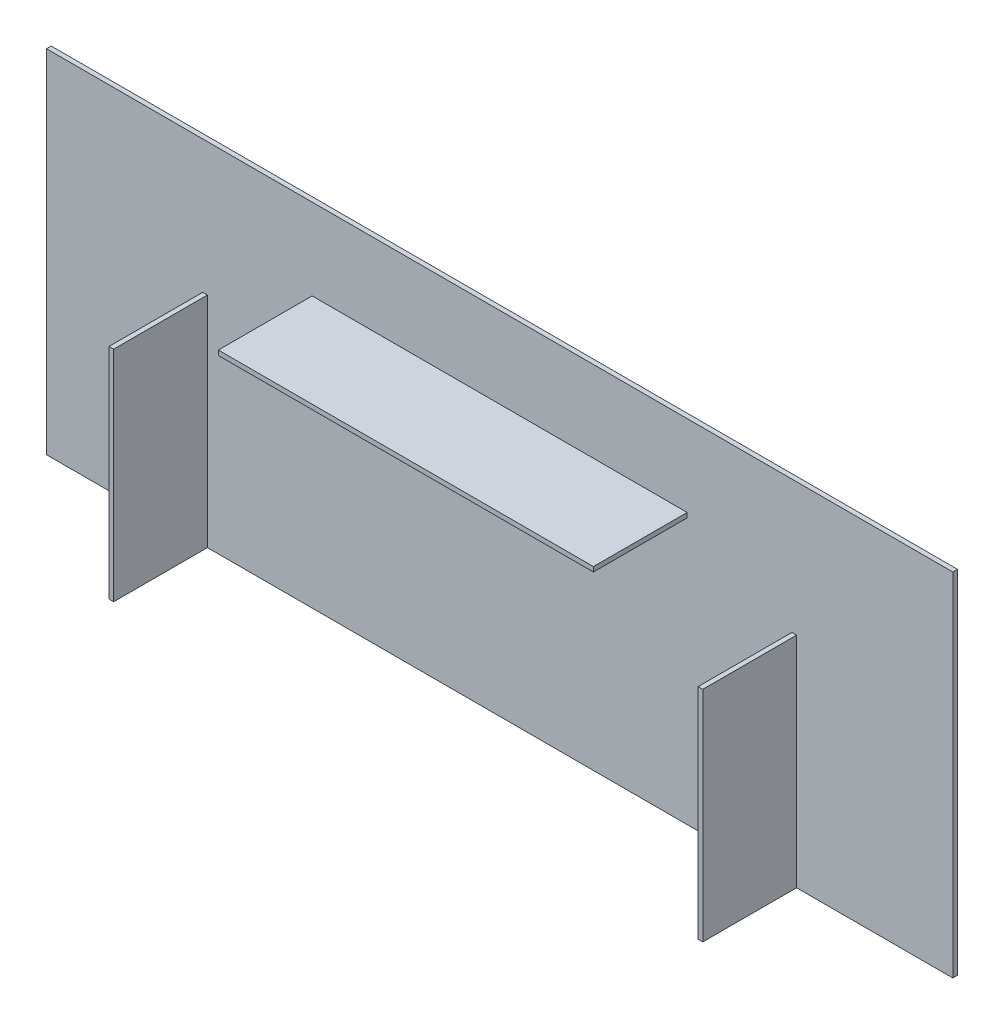
ISO-10303-21;
HEADER;
FILE_DESCRIPTION(('STEP AP214'),'2;1');
FILE_NAME('part.step','',(''),(''),'','','');
FILE_SCHEMA(('AUTOMOTIVE_DESIGN { 1 0 10303 214 1 1 1 1 }'));
ENDSEC;
DATA;
#1=APPLICATION_CONTEXT('core data for automotive mechanical design processes');
#2=APPLICATION_PROTOCOL_DEFINITION('international standard','automotive_design',2000,#1);
#3=PRODUCT_CONTEXT('',#1,'mechanical');
#4=PRODUCT('Part','Part','',(#3));
#5=PRODUCT_RELATED_PRODUCT_CATEGORY('part','',(#4));
#6=PRODUCT_DEFINITION_FORMATION('','',#4);
#7=PRODUCT_DEFINITION_CONTEXT('part definition',#1,'design');
#8=PRODUCT_DEFINITION('design','',#6,#7);
#9=PRODUCT_DEFINITION_SHAPE('','',#8);
#10=(LENGTH_UNIT() NAMED_UNIT(*) SI_UNIT(.MILLI.,.METRE.));
#11=(NAMED_UNIT(*) PLANE_ANGLE_UNIT() SI_UNIT($,.RADIAN.));
#12=(NAMED_UNIT(*) SI_UNIT($,.STERADIAN.) SOLID_ANGLE_UNIT());
#13=UNCERTAINTY_MEASURE_WITH_UNIT(LENGTH_MEASURE(1.E-05),#10,'distance_accuracy_value','');
#14=(GEOMETRIC_REPRESENTATION_CONTEXT(3) GLOBAL_UNCERTAINTY_ASSIGNED_CONTEXT((#13)) GLOBAL_UNIT_ASSIGNED_CONTEXT((#10,
#11,#12)) REPRESENTATION_CONTEXT('',''));
#15=CARTESIAN_POINT('',(0.,0.,0.));
#16=DIRECTION('',(0.,0.,1.));
#17=DIRECTION('',(1.,0.,0.));
#18=AXIS2_PLACEMENT_3D('',#15,#16,#17);
#19=CARTESIAN_POINT('',(0.,0.,1.5));
#20=DIRECTION('',(0.,0.,-1.));
#21=DIRECTION('',(-1.,0.,0.));
#22=AXIS2_PLACEMENT_3D('',#19,#20,#21);
#23=PLANE('',#22);
#24=DIRECTION('',(0.,-1.,0.));
#25=VECTOR('',#24,1.);
#26=CARTESIAN_POINT('',(-92.068661971831,56.7904929577465,1.5));
#27=LINE('',#26,#25);
#28=CARTESIAN_POINT('',(-92.068661971831,56.7904929577465,1.5));
#29=VERTEX_POINT('',#28);
#30=CARTESIAN_POINT('',(-92.068661971831,55.2904929577465,1.5));
#31=VERTEX_POINT('',#30);
#32=EDGE_CURVE('E229',#29,#31,#27,.T.);
#33=ORIENTED_EDGE('',*,*,#32,.F.);
#34=DIRECTION('',(1.,0.,0.));
#35=VECTOR('',#34,1.);
#36=CARTESIAN_POINT('',(-92.068661971831,56.7904929577465,1.5));
#37=LINE('',#36,#35);
#38=CARTESIAN_POINT('',(27.931338028169,56.7904929577465,1.5));
#39=VERTEX_POINT('',#38);
#40=EDGE_CURVE('E216',#29,#39,#37,.T.);
#41=ORIENTED_EDGE('',*,*,#40,.T.);
#42=DIRECTION('',(0.,-1.,0.));
#43=VECTOR('',#42,1.);
#44=CARTESIAN_POINT('',(27.931338028169,56.7904929577465,1.5));
#45=LINE('',#44,#43);
#46=CARTESIAN_POINT('',(27.931338028169,55.2904929577465,1.5));
#47=VERTEX_POINT('',#46);
#48=EDGE_CURVE('E220',#39,#47,#45,.T.);
#49=ORIENTED_EDGE('',*,*,#48,.T.);
#50=DIRECTION('',(1.,0.,0.));
#51=VECTOR('',#50,1.);
#52=CARTESIAN_POINT('',(-92.068661971831,55.2904929577465,1.5));
#53=LINE('',#52,#51);
#54=EDGE_CURVE('E225',#31,#47,#53,.T.);
#55=ORIENTED_EDGE('',*,*,#54,.F.);
#56=EDGE_LOOP('',(#33,#41,#49,#55));
#57=FACE_BOUND('',#56,.T.);
#58=DIRECTION('',(0.,1.,0.));
#59=VECTOR('',#58,1.);
#60=CARTESIAN_POINT('',(62.931338028169,-29.7095070422535,1.5));
#61=LINE('',#60,#59);
#62=CARTESIAN_POINT('',(62.931338028169,-29.7095070422535,1.5));
#63=VERTEX_POINT('',#62);
#64=CARTESIAN_POINT('',(62.931338028169,40.2904929577465,1.5));
#65=VERTEX_POINT('',#64);
#66=EDGE_CURVE('E168',#63,#65,#61,.T.);
#67=ORIENTED_EDGE('',*,*,#66,.F.);
#68=DIRECTION('',(1.,0.,0.));
#69=VECTOR('',#68,1.);
#70=CARTESIAN_POINT('',(-177.068661971831,-29.7095070422535,1.5));
#71=LINE('',#70,#69);
#72=CARTESIAN_POINT('',(112.931338028169,-29.7095070422535,1.5));
#73=VERTEX_POINT('',#72);
#74=EDGE_CURVE('E153',#63,#73,#71,.T.);
#75=ORIENTED_EDGE('',*,*,#74,.T.);
#76=DIRECTION('',(0.,-1.,0.));
#77=VECTOR('',#76,1.);
#78=CARTESIAN_POINT('',(112.931338028169,82.7904929577465,1.5));
#79=LINE('',#78,#77);
#80=CARTESIAN_POINT('',(112.931338028169,82.7904929577465,1.5));
#81=VERTEX_POINT('',#80);
#82=EDGE_CURVE('E165',#81,#73,#79,.T.);
#83=ORIENTED_EDGE('',*,*,#82,.F.);
#84=DIRECTION('',(1.,0.,0.));
#85=VECTOR('',#84,1.);
#86=CARTESIAN_POINT('',(-177.068661971831,82.7904929577465,1.5));
#87=LINE('',#86,#85);
#88=CARTESIAN_POINT('',(-177.068661971831,82.7904929577465,1.5));
#89=VERTEX_POINT('',#88);
#90=EDGE_CURVE('E288',#89,#81,#87,.T.);
#91=ORIENTED_EDGE('',*,*,#90,.F.);
#92=DIRECTION('',(0.,-1.,0.));
#93=VECTOR('',#92,1.);
#94=CARTESIAN_POINT('',(-177.068661971831,82.7904929577465,1.5));
#95=LINE('',#94,#93);
#96=CARTESIAN_POINT('',(-177.068661971831,-29.7095070422535,1.5));
#97=VERTEX_POINT('',#96);
#98=EDGE_CURVE('E296',#89,#97,#95,.T.);
#99=ORIENTED_EDGE('',*,*,#98,.T.);
#100=CARTESIAN_POINT('',(-127.068661971831,-29.7095070422535,1.5));
#101=VERTEX_POINT('',#100);
#102=EDGE_CURVE('E167',#97,#101,#71,.T.);
#103=ORIENTED_EDGE('',*,*,#102,.T.);
#104=DIRECTION('',(0.,1.,0.));
#105=VECTOR('',#104,1.);
#106=CARTESIAN_POINT('',(-127.068661971831,-29.7095070422535,1.5));
#107=LINE('',#106,#105);
#108=CARTESIAN_POINT('',(-127.068661971831,40.2904929577465,1.5));
#109=VERTEX_POINT('',#108);
#110=EDGE_CURVE('E233',#101,#109,#107,.T.);
#111=ORIENTED_EDGE('',*,*,#110,.T.);
#112=DIRECTION('',(-1.,0.,0.));
#113=VECTOR('',#112,1.);
#114=CARTESIAN_POINT('',(-125.568661971831,40.2904929577465,1.5));
#115=LINE('',#114,#113);
#116=CARTESIAN_POINT('',(-125.568661971831,40.2904929577465,1.5));
#117=VERTEX_POINT('',#116);
#118=EDGE_CURVE('E265',#117,#109,#115,.T.);
#119=ORIENTED_EDGE('',*,*,#118,.F.);
#120=DIRECTION('',(0.,1.,0.));
#121=VECTOR('',#120,1.);
#122=CARTESIAN_POINT('',(-125.568661971831,-29.7095070422535,1.5));
#123=LINE('',#122,#121);
#124=CARTESIAN_POINT('',(-125.568661971831,-29.7095070422535,1.5));
#125=VERTEX_POINT('',#124);
#126=EDGE_CURVE('E252',#125,#117,#123,.T.);
#127=ORIENTED_EDGE('',*,*,#126,.F.);
#128=CARTESIAN_POINT('',(61.431338028169,-29.7095070422535,1.5));
#129=VERTEX_POINT('',#128);
#130=EDGE_CURVE('E164',#125,#129,#71,.T.);
#131=ORIENTED_EDGE('',*,*,#130,.T.);
#132=DIRECTION('',(0.,1.,0.));
#133=VECTOR('',#132,1.);
#134=CARTESIAN_POINT('',(61.431338028169,-29.7095070422535,1.5));
#135=LINE('',#134,#133);
#136=CARTESIAN_POINT('',(61.431338028169,40.2904929577465,1.5));
#137=VERTEX_POINT('',#136);
#138=EDGE_CURVE('E62',#129,#137,#135,.T.);
#139=ORIENTED_EDGE('',*,*,#138,.T.);
#140=DIRECTION('',(-1.,0.,0.));
#141=VECTOR('',#140,1.);
#142=CARTESIAN_POINT('',(62.931338028169,40.2904929577465,1.5));
#143=LINE('',#142,#141);
#144=EDGE_CURVE('E57',#65,#137,#143,.T.);
#145=ORIENTED_EDGE('',*,*,#144,.F.);
#146=EDGE_LOOP('',(#67,#75,#83,#91,#99,#103,#111,#119,#127,#131,#139,#145));
#147=FACE_BOUND('',#146,.T.);
#148=ADVANCED_FACE('F39',(#57,#147),#23,.F.);
#149=CARTESIAN_POINT('',(-177.068661971831,82.7904929577465,1.5));
#150=DIRECTION('',(0.,1.,0.));
#151=DIRECTION('',(-1.,0.,0.));
#152=AXIS2_PLACEMENT_3D('',#149,#150,#151);
#153=PLANE('',#152);
#154=DIRECTION('',(1.,0.,0.));
#155=VECTOR('',#154,1.);
#156=CARTESIAN_POINT('',(-177.068661971831,82.7904929577465,0.));
#157=LINE('',#156,#155);
#158=CARTESIAN_POINT('',(-177.068661971831,82.7904929577465,0.));
#159=VERTEX_POINT('',#158);
#160=CARTESIAN_POINT('',(112.931338028169,82.7904929577465,0.));
#161=VERTEX_POINT('',#160);
#162=EDGE_CURVE('E276',#159,#161,#157,.T.);
#163=ORIENTED_EDGE('',*,*,#162,.F.);
#164=DIRECTION('',(0.,0.,-1.));
#165=VECTOR('',#164,1.);
#166=CARTESIAN_POINT('',(-177.068661971831,82.7904929577465,1.5));
#167=LINE('',#166,#165);
#168=EDGE_CURVE('E11',#89,#159,#167,.T.);
#169=ORIENTED_EDGE('',*,*,#168,.F.);
#170=ORIENTED_EDGE('',*,*,#90,.T.);
#171=DIRECTION('',(0.,0.,-1.));
#172=VECTOR('',#171,1.);
#173=CARTESIAN_POINT('',(112.931338028169,82.7904929577465,1.5));
#174=LINE('',#173,#172);
#175=EDGE_CURVE('E43',#81,#161,#174,.T.);
#176=ORIENTED_EDGE('',*,*,#175,.T.);
#177=EDGE_LOOP('',(#163,#169,#170,#176));
#178=FACE_BOUND('',#177,.T.);
#179=ADVANCED_FACE('F41',(#178),#153,.T.);
#180=CARTESIAN_POINT('',(-177.068661971831,82.7904929577465,1.5));
#181=DIRECTION('',(1.,0.,0.));
#182=DIRECTION('',(0.,0.,-1.));
#183=AXIS2_PLACEMENT_3D('',#180,#181,#182);
#184=PLANE('',#183);
#185=DIRECTION('',(0.,-1.,0.));
#186=VECTOR('',#185,1.);
#187=CARTESIAN_POINT('',(-177.068661971831,82.7904929577465,0.));
#188=LINE('',#187,#186);
#189=CARTESIAN_POINT('',(-177.068661971831,-29.7095070422535,0.));
#190=VERTEX_POINT('',#189);
#191=EDGE_CURVE('E292',#159,#190,#188,.T.);
#192=ORIENTED_EDGE('',*,*,#191,.T.);
#193=DIRECTION('',(0.,0.,-1.));
#194=VECTOR('',#193,1.);
#195=CARTESIAN_POINT('',(-177.068661971831,-29.7095070422535,1.5));
#196=LINE('',#195,#194);
#197=EDGE_CURVE('E49',#97,#190,#196,.T.);
#198=ORIENTED_EDGE('',*,*,#197,.F.);
#199=ORIENTED_EDGE('',*,*,#98,.F.);
#200=ORIENTED_EDGE('',*,*,#168,.T.);
#201=EDGE_LOOP('',(#192,#198,#199,#200));
#202=FACE_BOUND('',#201,.T.);
#203=ADVANCED_FACE('F327',(#202),#184,.F.);
#204=CARTESIAN_POINT('',(-177.068661971831,-29.7095070422535,1.5));
#205=DIRECTION('',(0.,1.,0.));
#206=DIRECTION('',(0.,0.,1.));
#207=AXIS2_PLACEMENT_3D('',#204,#205,#206);
#208=PLANE('',#207);
#209=DIRECTION('',(1.,0.,0.));
#210=VECTOR('',#209,1.);
#211=CARTESIAN_POINT('',(-177.068661971831,-29.7095070422535,0.));
#212=LINE('',#211,#210);
#213=CARTESIAN_POINT('',(112.931338028169,-29.7095070422535,0.));
#214=VERTEX_POINT('',#213);
#215=EDGE_CURVE('E306',#190,#214,#212,.T.);
#216=ORIENTED_EDGE('',*,*,#215,.T.);
#217=DIRECTION('',(0.,0.,-1.));
#218=VECTOR('',#217,1.);
#219=CARTESIAN_POINT('',(112.931338028169,-29.7095070422535,1.5));
#220=LINE('',#219,#218);
#221=EDGE_CURVE('E160',#73,#214,#220,.T.);
#222=ORIENTED_EDGE('',*,*,#221,.F.);
#223=ORIENTED_EDGE('',*,*,#74,.F.);
#224=DIRECTION('',(0.,0.,-1.));
#225=VECTOR('',#224,1.);
#226=CARTESIAN_POINT('',(62.931338028169,-29.7095070422535,31.5));
#227=LINE('',#226,#225);
#228=CARTESIAN_POINT('',(62.931338028169,-29.7095070422535,31.5));
#229=VERTEX_POINT('',#228);
#230=EDGE_CURVE('E158',#229,#63,#227,.T.);
#231=ORIENTED_EDGE('',*,*,#230,.F.);
#232=DIRECTION('',(-1.,0.,0.));
#233=VECTOR('',#232,1.);
#234=CARTESIAN_POINT('',(62.931338028169,-29.7095070422535,31.5));
#235=LINE('',#234,#233);
#236=CARTESIAN_POINT('',(61.431338028169,-29.7095070422535,31.5));
#237=VERTEX_POINT('',#236);
#238=EDGE_CURVE('E173',#229,#237,#235,.T.);
#239=ORIENTED_EDGE('',*,*,#238,.T.);
#240=DIRECTION('',(0.,0.,-1.));
#241=VECTOR('',#240,1.);
#242=CARTESIAN_POINT('',(61.431338028169,-29.7095070422535,31.5));
#243=LINE('',#242,#241);
#244=EDGE_CURVE('E194',#237,#129,#243,.T.);
#245=ORIENTED_EDGE('',*,*,#244,.T.);
#246=ORIENTED_EDGE('',*,*,#130,.F.);
#247=DIRECTION('',(0.,0.,-1.));
#248=VECTOR('',#247,1.);
#249=CARTESIAN_POINT('',(-125.568661971831,-29.7095070422535,31.5));
#250=LINE('',#249,#248);
#251=CARTESIAN_POINT('',(-125.568661971831,-29.7095070422535,31.5));
#252=VERTEX_POINT('',#251);
#253=EDGE_CURVE('E272',#252,#125,#250,.T.);
#254=ORIENTED_EDGE('',*,*,#253,.F.);
#255=DIRECTION('',(-1.,0.,0.));
#256=VECTOR('',#255,1.);
#257=CARTESIAN_POINT('',(-125.568661971831,-29.7095070422535,31.5));
#258=LINE('',#257,#256);
#259=CARTESIAN_POINT('',(-127.068661971831,-29.7095070422535,31.5));
#260=VERTEX_POINT('',#259);
#261=EDGE_CURVE('E247',#252,#260,#258,.T.);
#262=ORIENTED_EDGE('',*,*,#261,.T.);
#263=DIRECTION('',(0.,0.,-1.));
#264=VECTOR('',#263,1.);
#265=CARTESIAN_POINT('',(-127.068661971831,-29.7095070422535,31.5));
#266=LINE('',#265,#264);
#267=EDGE_CURVE('E262',#260,#101,#266,.T.);
#268=ORIENTED_EDGE('',*,*,#267,.T.);
#269=ORIENTED_EDGE('',*,*,#102,.F.);
#270=ORIENTED_EDGE('',*,*,#197,.T.);
#271=EDGE_LOOP('',(#216,#222,#223,#231,#239,#245,#246,#254,#262,#268,#269,#270));
#272=FACE_BOUND('',#271,.T.);
#273=ADVANCED_FACE('F155',(#272),#208,.F.);
#274=CARTESIAN_POINT('',(112.931338028169,82.7904929577465,1.5));
#275=DIRECTION('',(1.,0.,0.));
#276=DIRECTION('',(0.,0.,-1.));
#277=AXIS2_PLACEMENT_3D('',#274,#275,#276);
#278=PLANE('',#277);
#279=DIRECTION('',(0.,-1.,0.));
#280=VECTOR('',#279,1.);
#281=CARTESIAN_POINT('',(112.931338028169,82.7904929577465,0.));
#282=LINE('',#281,#280);
#283=EDGE_CURVE('E302',#161,#214,#282,.T.);
#284=ORIENTED_EDGE('',*,*,#283,.F.);
#285=ORIENTED_EDGE('',*,*,#175,.F.);
#286=ORIENTED_EDGE('',*,*,#82,.T.);
#287=ORIENTED_EDGE('',*,*,#221,.T.);
#288=EDGE_LOOP('',(#284,#285,#286,#287));
#289=FACE_BOUND('',#288,.T.);
#290=ADVANCED_FACE('F320',(#289),#278,.T.);
#291=CARTESIAN_POINT('',(0.,0.,0.));
#292=DIRECTION('',(0.,0.,-1.));
#293=DIRECTION('',(-1.,0.,0.));
#294=AXIS2_PLACEMENT_3D('',#291,#292,#293);
#295=PLANE('',#294);
#296=ORIENTED_EDGE('',*,*,#162,.T.);
#297=ORIENTED_EDGE('',*,*,#283,.T.);
#298=ORIENTED_EDGE('',*,*,#215,.F.);
#299=ORIENTED_EDGE('',*,*,#191,.F.);
#300=EDGE_LOOP('',(#296,#297,#298,#299));
#301=FACE_BOUND('',#300,.T.);
#302=ADVANCED_FACE('F324',(#301),#295,.T.);
#303=CARTESIAN_POINT('',(-125.568661971831,-29.7095070422535,31.5));
#304=DIRECTION('',(-1.,0.,0.));
#305=DIRECTION('',(0.,0.,1.));
#306=AXIS2_PLACEMENT_3D('',#303,#304,#305);
#307=PLANE('',#306);
#308=ORIENTED_EDGE('',*,*,#126,.T.);
#309=DIRECTION('',(0.,0.,-1.));
#310=VECTOR('',#309,1.);
#311=CARTESIAN_POINT('',(-125.568661971831,40.2904929577465,31.5));
#312=LINE('',#311,#310);
#313=CARTESIAN_POINT('',(-125.568661971831,40.2904929577465,31.5));
#314=VERTEX_POINT('',#313);
#315=EDGE_CURVE('E277',#314,#117,#312,.T.);
#316=ORIENTED_EDGE('',*,*,#315,.F.);
#317=DIRECTION('',(0.,1.,0.));
#318=VECTOR('',#317,1.);
#319=CARTESIAN_POINT('',(-125.568661971831,-29.7095070422535,31.5));
#320=LINE('',#319,#318);
#321=EDGE_CURVE('E259',#252,#314,#320,.T.);
#322=ORIENTED_EDGE('',*,*,#321,.F.);
#323=ORIENTED_EDGE('',*,*,#253,.T.);
#324=EDGE_LOOP('',(#308,#316,#322,#323));
#325=FACE_BOUND('',#324,.T.);
#326=ADVANCED_FACE('F341',(#325),#307,.F.);
#327=CARTESIAN_POINT('',(-125.568661971831,40.2904929577465,31.5));
#328=DIRECTION('',(0.,-1.,0.));
#329=DIRECTION('',(0.,0.,-1.));
#330=AXIS2_PLACEMENT_3D('',#327,#328,#329);
#331=PLANE('',#330);
#332=ORIENTED_EDGE('',*,*,#118,.T.);
#333=DIRECTION('',(0.,0.,-1.));
#334=VECTOR('',#333,1.);
#335=CARTESIAN_POINT('',(-127.068661971831,40.2904929577465,31.5));
#336=LINE('',#335,#334);
#337=CARTESIAN_POINT('',(-127.068661971831,40.2904929577465,31.5));
#338=VERTEX_POINT('',#337);
#339=EDGE_CURVE('E281',#338,#109,#336,.T.);
#340=ORIENTED_EDGE('',*,*,#339,.F.);
#341=DIRECTION('',(-1.,0.,0.));
#342=VECTOR('',#341,1.);
#343=CARTESIAN_POINT('',(-125.568661971831,40.2904929577465,31.5));
#344=LINE('',#343,#342);
#345=EDGE_CURVE('E256',#314,#338,#344,.T.);
#346=ORIENTED_EDGE('',*,*,#345,.F.);
#347=ORIENTED_EDGE('',*,*,#315,.T.);
#348=EDGE_LOOP('',(#332,#340,#346,#347));
#349=FACE_BOUND('',#348,.T.);
#350=ADVANCED_FACE('F337',(#349),#331,.F.);
#351=CARTESIAN_POINT('',(-127.068661971831,-29.7095070422535,31.5));
#352=DIRECTION('',(-1.,0.,0.));
#353=DIRECTION('',(0.,0.,1.));
#354=AXIS2_PLACEMENT_3D('',#351,#352,#353);
#355=PLANE('',#354);
#356=ORIENTED_EDGE('',*,*,#110,.F.);
#357=ORIENTED_EDGE('',*,*,#267,.F.);
#358=DIRECTION('',(0.,1.,0.));
#359=VECTOR('',#358,1.);
#360=CARTESIAN_POINT('',(-127.068661971831,-29.7095070422535,31.5));
#361=LINE('',#360,#359);
#362=EDGE_CURVE('E251',#260,#338,#361,.T.);
#363=ORIENTED_EDGE('',*,*,#362,.T.);
#364=ORIENTED_EDGE('',*,*,#339,.T.);
#365=EDGE_LOOP('',(#356,#357,#363,#364));
#366=FACE_BOUND('',#365,.T.);
#367=ADVANCED_FACE('F333',(#366),#355,.T.);
#368=CARTESIAN_POINT('',(0.,0.,31.5));
#369=DIRECTION('',(0.,0.,-1.));
#370=DIRECTION('',(-1.,0.,0.));
#371=AXIS2_PLACEMENT_3D('',#368,#369,#370);
#372=PLANE('',#371);
#373=ORIENTED_EDGE('',*,*,#261,.F.);
#374=ORIENTED_EDGE('',*,*,#321,.T.);
#375=ORIENTED_EDGE('',*,*,#345,.T.);
#376=ORIENTED_EDGE('',*,*,#362,.F.);
#377=EDGE_LOOP('',(#373,#374,#375,#376));
#378=FACE_BOUND('',#377,.T.);
#379=ADVANCED_FACE('F408',(#378),#372,.F.);
#380=CARTESIAN_POINT('',(-92.068661971831,56.7904929577465,31.5));
#381=DIRECTION('',(1.,0.,0.));
#382=DIRECTION('',(0.,0.,-1.));
#383=AXIS2_PLACEMENT_3D('',#380,#381,#382);
#384=PLANE('',#383);
#385=ORIENTED_EDGE('',*,*,#32,.T.);
#386=DIRECTION('',(0.,0.,-1.));
#387=VECTOR('',#386,1.);
#388=CARTESIAN_POINT('',(-92.068661971831,55.2904929577465,31.5));
#389=LINE('',#388,#387);
#390=CARTESIAN_POINT('',(-92.068661971831,55.2904929577465,31.5));
#391=VERTEX_POINT('',#390);
#392=EDGE_CURVE('E190',#391,#31,#389,.T.);
#393=ORIENTED_EDGE('',*,*,#392,.F.);
#394=DIRECTION('',(0.,-1.,0.));
#395=VECTOR('',#394,1.);
#396=CARTESIAN_POINT('',(-92.068661971831,56.7904929577465,31.5));
#397=LINE('',#396,#395);
#398=CARTESIAN_POINT('',(-92.068661971831,56.7904929577465,31.5));
#399=VERTEX_POINT('',#398);
#400=EDGE_CURVE('E221',#399,#391,#397,.T.);
#401=ORIENTED_EDGE('',*,*,#400,.F.);
#402=DIRECTION('',(0.,0.,-1.));
#403=VECTOR('',#402,1.);
#404=CARTESIAN_POINT('',(-92.068661971831,56.7904929577465,31.5));
#405=LINE('',#404,#403);
#406=EDGE_CURVE('E212',#399,#29,#405,.T.);
#407=ORIENTED_EDGE('',*,*,#406,.T.);
#408=EDGE_LOOP('',(#385,#393,#401,#407));
#409=FACE_BOUND('',#408,.T.);
#410=ADVANCED_FACE('F414',(#409),#384,.F.);
#411=CARTESIAN_POINT('',(-92.068661971831,55.2904929577465,31.5));
#412=DIRECTION('',(0.,1.,0.));
#413=DIRECTION('',(0.,0.,1.));
#414=AXIS2_PLACEMENT_3D('',#411,#412,#413);
#415=PLANE('',#414);
#416=ORIENTED_EDGE('',*,*,#54,.T.);
#417=DIRECTION('',(0.,0.,-1.));
#418=VECTOR('',#417,1.);
#419=CARTESIAN_POINT('',(27.931338028169,55.2904929577465,31.5));
#420=LINE('',#419,#418);
#421=CARTESIAN_POINT('',(27.931338028169,55.2904929577465,31.5));
#422=VERTEX_POINT('',#421);
#423=EDGE_CURVE('E205',#422,#47,#420,.T.);
#424=ORIENTED_EDGE('',*,*,#423,.F.);
#425=DIRECTION('',(1.,0.,0.));
#426=VECTOR('',#425,1.);
#427=CARTESIAN_POINT('',(-92.068661971831,55.2904929577465,31.5));
#428=LINE('',#427,#426);
#429=EDGE_CURVE('E241',#391,#422,#428,.T.);
#430=ORIENTED_EDGE('',*,*,#429,.F.);
#431=ORIENTED_EDGE('',*,*,#392,.T.);
#432=EDGE_LOOP('',(#416,#424,#430,#431));
#433=FACE_BOUND('',#432,.T.);
#434=ADVANCED_FACE('F422',(#433),#415,.F.);
#435=CARTESIAN_POINT('',(27.931338028169,56.7904929577465,31.5));
#436=DIRECTION('',(1.,0.,0.));
#437=DIRECTION('',(0.,0.,-1.));
#438=AXIS2_PLACEMENT_3D('',#435,#436,#437);
#439=PLANE('',#438);
#440=ORIENTED_EDGE('',*,*,#48,.F.);
#441=DIRECTION('',(0.,0.,-1.));
#442=VECTOR('',#441,1.);
#443=CARTESIAN_POINT('',(27.931338028169,56.7904929577465,31.5));
#444=LINE('',#443,#442);
#445=CARTESIAN_POINT('',(27.931338028169,56.7904929577465,31.5));
#446=VERTEX_POINT('',#445);
#447=EDGE_CURVE('E208',#446,#39,#444,.T.);
#448=ORIENTED_EDGE('',*,*,#447,.F.);
#449=DIRECTION('',(0.,-1.,0.));
#450=VECTOR('',#449,1.);
#451=CARTESIAN_POINT('',(27.931338028169,56.7904929577465,31.5));
#452=LINE('',#451,#450);
#453=EDGE_CURVE('E237',#446,#422,#452,.T.);
#454=ORIENTED_EDGE('',*,*,#453,.T.);
#455=ORIENTED_EDGE('',*,*,#423,.T.);
#456=EDGE_LOOP('',(#440,#448,#454,#455));
#457=FACE_BOUND('',#456,.T.);
#458=ADVANCED_FACE('F429',(#457),#439,.T.);
#459=CARTESIAN_POINT('',(-92.068661971831,56.7904929577465,31.5));
#460=DIRECTION('',(0.,1.,0.));
#461=DIRECTION('',(0.,0.,1.));
#462=AXIS2_PLACEMENT_3D('',#459,#460,#461);
#463=PLANE('',#462);
#464=ORIENTED_EDGE('',*,*,#40,.F.);
#465=ORIENTED_EDGE('',*,*,#406,.F.);
#466=DIRECTION('',(1.,0.,0.));
#467=VECTOR('',#466,1.);
#468=CARTESIAN_POINT('',(-92.068661971831,56.7904929577465,31.5));
#469=LINE('',#468,#467);
#470=EDGE_CURVE('E215',#399,#446,#469,.T.);
#471=ORIENTED_EDGE('',*,*,#470,.T.);
#472=ORIENTED_EDGE('',*,*,#447,.T.);
#473=EDGE_LOOP('',(#464,#465,#471,#472));
#474=FACE_BOUND('',#473,.T.);
#475=ADVANCED_FACE('F437',(#474),#463,.T.);
#476=CARTESIAN_POINT('',(0.,0.,31.5));
#477=DIRECTION('',(0.,0.,1.));
#478=DIRECTION('',(1.,0.,0.));
#479=AXIS2_PLACEMENT_3D('',#476,#477,#478);
#480=PLANE('',#479);
#481=ORIENTED_EDGE('',*,*,#400,.T.);
#482=ORIENTED_EDGE('',*,*,#429,.T.);
#483=ORIENTED_EDGE('',*,*,#453,.F.);
#484=ORIENTED_EDGE('',*,*,#470,.F.);
#485=EDGE_LOOP('',(#481,#482,#483,#484));
#486=FACE_BOUND('',#485,.T.);
#487=ADVANCED_FACE('F445',(#486),#480,.T.);
#488=CARTESIAN_POINT('',(62.931338028169,-29.7095070422535,31.5));
#489=DIRECTION('',(-1.,0.,0.));
#490=DIRECTION('',(0.,-1.,0.));
#491=AXIS2_PLACEMENT_3D('',#488,#489,#490);
#492=PLANE('',#491);
#493=ORIENTED_EDGE('',*,*,#66,.T.);
#494=DIRECTION('',(0.,0.,-1.));
#495=VECTOR('',#494,1.);
#496=CARTESIAN_POINT('',(62.931338028169,40.2904929577465,31.5));
#497=LINE('',#496,#495);
#498=CARTESIAN_POINT('',(62.931338028169,40.2904929577465,31.5));
#499=VERTEX_POINT('',#498);
#500=EDGE_CURVE('E179',#499,#65,#497,.T.);
#501=ORIENTED_EDGE('',*,*,#500,.F.);
#502=DIRECTION('',(0.,1.,0.));
#503=VECTOR('',#502,1.);
#504=CARTESIAN_POINT('',(62.931338028169,-29.7095070422535,31.5));
#505=LINE('',#504,#503);
#506=EDGE_CURVE('E176',#229,#499,#505,.T.);
#507=ORIENTED_EDGE('',*,*,#506,.F.);
#508=ORIENTED_EDGE('',*,*,#230,.T.);
#509=EDGE_LOOP('',(#493,#501,#507,#508));
#510=FACE_BOUND('',#509,.T.);
#511=ADVANCED_FACE('F175',(#510),#492,.F.);
#512=CARTESIAN_POINT('',(62.931338028169,40.2904929577465,31.5));
#513=DIRECTION('',(0.,-1.,0.));
#514=DIRECTION('',(0.,0.,-1.));
#515=AXIS2_PLACEMENT_3D('',#512,#513,#514);
#516=PLANE('',#515);
#517=ORIENTED_EDGE('',*,*,#144,.T.);
#518=DIRECTION('',(0.,0.,-1.));
#519=VECTOR('',#518,1.);
#520=CARTESIAN_POINT('',(61.431338028169,40.2904929577465,31.5));
#521=LINE('',#520,#519);
#522=CARTESIAN_POINT('',(61.431338028169,40.2904929577465,31.5));
#523=VERTEX_POINT('',#522);
#524=EDGE_CURVE('E182',#523,#137,#521,.T.);
#525=ORIENTED_EDGE('',*,*,#524,.F.);
#526=DIRECTION('',(-1.,0.,0.));
#527=VECTOR('',#526,1.);
#528=CARTESIAN_POINT('',(62.931338028169,40.2904929577465,31.5));
#529=LINE('',#528,#527);
#530=EDGE_CURVE('E193',#499,#523,#529,.T.);
#531=ORIENTED_EDGE('',*,*,#530,.F.);
#532=ORIENTED_EDGE('',*,*,#500,.T.);
#533=EDGE_LOOP('',(#517,#525,#531,#532));
#534=FACE_BOUND('',#533,.T.);
#535=ADVANCED_FACE('F355',(#534),#516,.F.);
#536=CARTESIAN_POINT('',(61.431338028169,-29.7095070422535,31.5));
#537=DIRECTION('',(-1.,0.,0.));
#538=DIRECTION('',(0.,0.,1.));
#539=AXIS2_PLACEMENT_3D('',#536,#537,#538);
#540=PLANE('',#539);
#541=ORIENTED_EDGE('',*,*,#138,.F.);
#542=ORIENTED_EDGE('',*,*,#244,.F.);
#543=DIRECTION('',(0.,1.,0.));
#544=VECTOR('',#543,1.);
#545=CARTESIAN_POINT('',(61.431338028169,-29.7095070422535,31.5));
#546=LINE('',#545,#544);
#547=EDGE_CURVE('E197',#237,#523,#546,.T.);
#548=ORIENTED_EDGE('',*,*,#547,.T.);
#549=ORIENTED_EDGE('',*,*,#524,.T.);
#550=EDGE_LOOP('',(#541,#542,#548,#549));
#551=FACE_BOUND('',#550,.T.);
#552=ADVANCED_FACE('F351',(#551),#540,.T.);
#553=CARTESIAN_POINT('',(0.,0.,31.5));
#554=DIRECTION('',(0.,0.,-1.));
#555=DIRECTION('',(-1.,0.,0.));
#556=AXIS2_PLACEMENT_3D('',#553,#554,#555);
#557=PLANE('',#556);
#558=ORIENTED_EDGE('',*,*,#238,.F.);
#559=ORIENTED_EDGE('',*,*,#506,.T.);
#560=ORIENTED_EDGE('',*,*,#530,.T.);
#561=ORIENTED_EDGE('',*,*,#547,.F.);
#562=EDGE_LOOP('',(#558,#559,#560,#561));
#563=FACE_BOUND('',#562,.T.);
#564=ADVANCED_FACE('F357',(#563),#557,.F.);
#565=CLOSED_SHELL('',(#148,#179,#203,#273,#290,#302,#326,#350,#367,#379,#410,#434,#458,#475,
#487,#511,#535,#552,#564));
#566=MANIFOLD_SOLID_BREP('B2',#565);
#567=ADVANCED_BREP_SHAPE_REPRESENTATION('',(#18,#566),#14);
#568=SHAPE_DEFINITION_REPRESENTATION(#9,#567);
ENDSEC;
END-ISO-10303-21;
